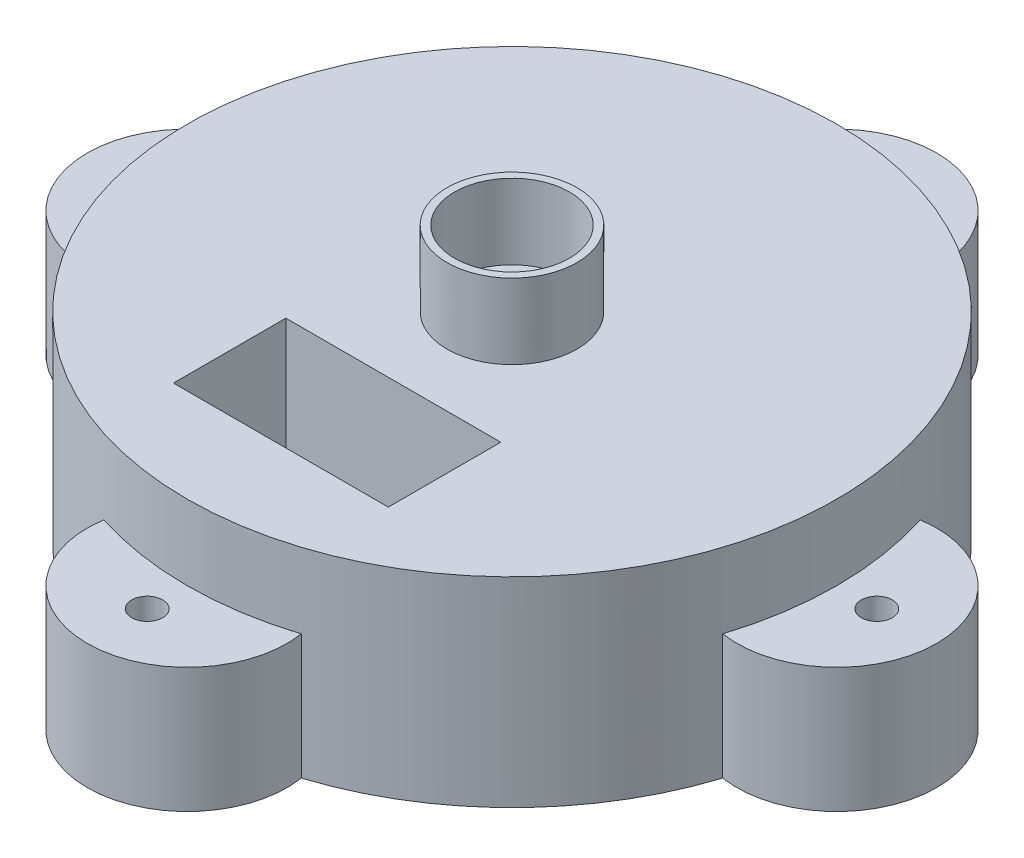
ISO-10303-21;
HEADER;
FILE_DESCRIPTION(('STEP AP214'),'2;1');
FILE_NAME('part.step','',(''),(''),'','','');
FILE_SCHEMA(('AUTOMOTIVE_DESIGN { 1 0 10303 214 1 1 1 1 }'));
ENDSEC;
DATA;
#1=APPLICATION_CONTEXT('core data for automotive mechanical design processes');
#2=APPLICATION_PROTOCOL_DEFINITION('international standard','automotive_design',2000,#1);
#3=PRODUCT_CONTEXT('',#1,'mechanical');
#4=PRODUCT('Part','Part','',(#3));
#5=PRODUCT_RELATED_PRODUCT_CATEGORY('part','',(#4));
#6=PRODUCT_DEFINITION_FORMATION('','',#4);
#7=PRODUCT_DEFINITION_CONTEXT('part definition',#1,'design');
#8=PRODUCT_DEFINITION('design','',#6,#7);
#9=PRODUCT_DEFINITION_SHAPE('','',#8);
#10=(LENGTH_UNIT() NAMED_UNIT(*) SI_UNIT(.MILLI.,.METRE.));
#11=(NAMED_UNIT(*) PLANE_ANGLE_UNIT() SI_UNIT($,.RADIAN.));
#12=(NAMED_UNIT(*) SI_UNIT($,.STERADIAN.) SOLID_ANGLE_UNIT());
#13=UNCERTAINTY_MEASURE_WITH_UNIT(LENGTH_MEASURE(1.E-05),#10,'distance_accuracy_value','');
#14=(GEOMETRIC_REPRESENTATION_CONTEXT(3) GLOBAL_UNCERTAINTY_ASSIGNED_CONTEXT((#13)) GLOBAL_UNIT_ASSIGNED_CONTEXT((#10,
#11,#12)) REPRESENTATION_CONTEXT('',''));
#15=CARTESIAN_POINT('',(0.,0.,0.));
#16=DIRECTION('',(0.,0.,1.));
#17=DIRECTION('',(1.,0.,0.));
#18=AXIS2_PLACEMENT_3D('',#15,#16,#17);
#19=CARTESIAN_POINT('',(0.,40.,0.));
#20=DIRECTION('',(0.,-1.,0.));
#21=DIRECTION('',(0.,0.,-1.));
#22=AXIS2_PLACEMENT_3D('',#19,#20,#21);
#23=CYLINDRICAL_SURFACE('',#22,65.);
#24=DIRECTION('',(0.,-1.,0.));
#25=VECTOR('',#24,1.);
#26=CARTESIAN_POINT('',(61.9230515913332,25.,19.7619756506552));
#27=LINE('',#26,#25);
#28=CARTESIAN_POINT('',(61.9230515913332,25.,19.7619756506552));
#29=VERTEX_POINT('',#28);
#30=CARTESIAN_POINT('',(61.9230515913332,0.,19.7619756506552));
#31=VERTEX_POINT('',#30);
#32=EDGE_CURVE('E231',#29,#31,#27,.T.);
#33=ORIENTED_EDGE('',*,*,#32,.F.);
#34=CARTESIAN_POINT('',(0.,25.,0.));
#35=DIRECTION('',(0.,-1.,0.));
#36=DIRECTION('',(0.,0.,-1.));
#37=AXIS2_PLACEMENT_3D('',#34,#35,#36);
#38=CIRCLE('',#37,65.);
#39=CARTESIAN_POINT('',(61.9231022547189,25.,-19.7618168990512));
#40=VERTEX_POINT('',#39);
#41=EDGE_CURVE('E222',#40,#29,#38,.T.);
#42=ORIENTED_EDGE('',*,*,#41,.F.);
#43=DIRECTION('',(0.,-1.,0.));
#44=VECTOR('',#43,1.);
#45=CARTESIAN_POINT('',(61.9231022547189,25.,-19.7618168990512));
#46=LINE('',#45,#44);
#47=CARTESIAN_POINT('',(61.9231022547189,0.,-19.7618168990512));
#48=VERTEX_POINT('',#47);
#49=EDGE_CURVE('E238',#40,#48,#46,.T.);
#50=ORIENTED_EDGE('',*,*,#49,.T.);
#51=CARTESIAN_POINT('',(0.,0.,0.));
#52=DIRECTION('',(0.,1.,0.));
#53=DIRECTION('',(0.,0.,1.));
#54=AXIS2_PLACEMENT_3D('',#51,#52,#53);
#55=CIRCLE('',#54,65.);
#56=CARTESIAN_POINT('',(19.761975650655,0.,-61.9230515913333));
#57=VERTEX_POINT('',#56);
#58=EDGE_CURVE('E377',#48,#57,#55,.T.);
#59=ORIENTED_EDGE('',*,*,#58,.T.);
#60=DIRECTION('',(0.,-1.,0.));
#61=VECTOR('',#60,1.);
#62=CARTESIAN_POINT('',(19.761975650655,25.,-61.9230515913333));
#63=LINE('',#62,#61);
#64=CARTESIAN_POINT('',(19.761975650655,25.,-61.9230515913333));
#65=VERTEX_POINT('',#64);
#66=EDGE_CURVE('E259',#65,#57,#63,.T.);
#67=ORIENTED_EDGE('',*,*,#66,.F.);
#68=CARTESIAN_POINT('',(0.,25.,0.));
#69=DIRECTION('',(0.,-1.,0.));
#70=DIRECTION('',(0.,0.,-1.));
#71=AXIS2_PLACEMENT_3D('',#68,#69,#70);
#72=CIRCLE('',#71,65.);
#73=CARTESIAN_POINT('',(-19.7618168990514,25.,-61.9231022547188));
#74=VERTEX_POINT('',#73);
#75=EDGE_CURVE('E250',#74,#65,#72,.T.);
#76=ORIENTED_EDGE('',*,*,#75,.F.);
#77=DIRECTION('',(0.,-1.,0.));
#78=VECTOR('',#77,1.);
#79=CARTESIAN_POINT('',(-19.7618168990514,25.,-61.9231022547188));
#80=LINE('',#79,#78);
#81=CARTESIAN_POINT('',(-19.7618168990514,0.,-61.9231022547188));
#82=VERTEX_POINT('',#81);
#83=EDGE_CURVE('E266',#74,#82,#80,.T.);
#84=ORIENTED_EDGE('',*,*,#83,.T.);
#85=CARTESIAN_POINT('',(-61.9230515913333,0.,-19.7619756506548));
#86=VERTEX_POINT('',#85);
#87=EDGE_CURVE('E380',#82,#86,#55,.T.);
#88=ORIENTED_EDGE('',*,*,#87,.T.);
#89=DIRECTION('',(0.,-1.,0.));
#90=VECTOR('',#89,1.);
#91=CARTESIAN_POINT('',(-61.9230515913333,25.,-19.7619756506548));
#92=LINE('',#91,#90);
#93=CARTESIAN_POINT('',(-61.9230515913333,25.,-19.7619756506548));
#94=VERTEX_POINT('',#93);
#95=EDGE_CURVE('E287',#94,#86,#92,.T.);
#96=ORIENTED_EDGE('',*,*,#95,.F.);
#97=CARTESIAN_POINT('',(0.,25.,0.));
#98=DIRECTION('',(0.,-1.,0.));
#99=DIRECTION('',(0.,0.,-1.));
#100=AXIS2_PLACEMENT_3D('',#97,#98,#99);
#101=CIRCLE('',#100,65.);
#102=CARTESIAN_POINT('',(-61.9231022547188,25.,19.7618168990516));
#103=VERTEX_POINT('',#102);
#104=EDGE_CURVE('E278',#103,#94,#101,.T.);
#105=ORIENTED_EDGE('',*,*,#104,.F.);
#106=DIRECTION('',(0.,-1.,0.));
#107=VECTOR('',#106,1.);
#108=CARTESIAN_POINT('',(-61.9231022547188,25.,19.7618168990516));
#109=LINE('',#108,#107);
#110=CARTESIAN_POINT('',(-61.9231022547188,0.,19.7618168990516));
#111=VERTEX_POINT('',#110);
#112=EDGE_CURVE('E294',#103,#111,#109,.T.);
#113=ORIENTED_EDGE('',*,*,#112,.T.);
#114=CARTESIAN_POINT('',(-19.7619756506545,0.,61.9230515913334));
#115=VERTEX_POINT('',#114);
#116=EDGE_CURVE('E372',#111,#115,#55,.T.);
#117=ORIENTED_EDGE('',*,*,#116,.T.);
#118=DIRECTION('',(0.,-1.,0.));
#119=VECTOR('',#118,1.);
#120=CARTESIAN_POINT('',(-19.7619756506545,25.,61.9230515913334));
#121=LINE('',#120,#119);
#122=CARTESIAN_POINT('',(-19.7619756506545,25.,61.9230515913334));
#123=VERTEX_POINT('',#122);
#124=EDGE_CURVE('E315',#123,#115,#121,.T.);
#125=ORIENTED_EDGE('',*,*,#124,.F.);
#126=CARTESIAN_POINT('',(0.,25.,0.));
#127=DIRECTION('',(0.,-1.,0.));
#128=DIRECTION('',(0.,0.,-1.));
#129=AXIS2_PLACEMENT_3D('',#126,#127,#128);
#130=CIRCLE('',#129,65.);
#131=CARTESIAN_POINT('',(19.7618168990518,25.,61.9231022547187));
#132=VERTEX_POINT('',#131);
#133=EDGE_CURVE('E311',#132,#123,#130,.T.);
#134=ORIENTED_EDGE('',*,*,#133,.F.);
#135=DIRECTION('',(0.,-1.,0.));
#136=VECTOR('',#135,1.);
#137=CARTESIAN_POINT('',(19.7618168990518,25.,61.9231022547187));
#138=LINE('',#137,#136);
#139=CARTESIAN_POINT('',(19.7618168990518,0.,61.9231022547187));
#140=VERTEX_POINT('',#139);
#141=EDGE_CURVE('E322',#132,#140,#138,.T.);
#142=ORIENTED_EDGE('',*,*,#141,.T.);
#143=EDGE_CURVE('E375',#140,#31,#55,.T.);
#144=ORIENTED_EDGE('',*,*,#143,.T.);
#145=EDGE_LOOP('',(#33,#42,#50,#59,#67,#76,#84,#88,#96,#105,#113,#117,#125,#134,#142,#144));
#146=FACE_BOUND('',#145,.T.);
#147=CARTESIAN_POINT('',(0.,40.,0.));
#148=DIRECTION('',(0.,1.,0.));
#149=DIRECTION('',(0.,0.,1.));
#150=AXIS2_PLACEMENT_3D('',#147,#148,#149);
#151=CIRCLE('',#150,65.);
#152=CARTESIAN_POINT('',(0.,40.,65.));
#153=VERTEX_POINT('',#152);
#154=EDGE_CURVE('E53',#153,#153,#151,.T.);
#155=ORIENTED_EDGE('',*,*,#154,.F.);
#156=EDGE_LOOP('',(#155));
#157=FACE_BOUND('',#156,.T.);
#158=DIRECTION('',(0.,-1.,0.));
#159=VECTOR('',#158,1.);
#160=CARTESIAN_POINT('',(-58.4024663648858,40.,28.5333475515648));
#161=LINE('',#160,#159);
#162=CARTESIAN_POINT('',(-58.4024663648858,12.326049230071,28.5333475515648));
#163=VERTEX_POINT('',#162);
#164=CARTESIAN_POINT('',(-58.4024663648858,7.32604923007102,28.5333475515648));
#165=VERTEX_POINT('',#164);
#166=EDGE_CURVE('E161',#163,#165,#161,.T.);
#167=ORIENTED_EDGE('',*,*,#166,.F.);
#168=CARTESIAN_POINT('',(0.,12.326049230071,0.));
#169=DIRECTION('',(0.,-1.,0.));
#170=DIRECTION('',(0.,0.,-1.));
#171=AXIS2_PLACEMENT_3D('',#168,#169,#170);
#172=CIRCLE('',#171,65.);
#173=CARTESIAN_POINT('',(-48.2684954287439,12.326049230071,43.5333475515648));
#174=VERTEX_POINT('',#173);
#175=EDGE_CURVE('E165',#174,#163,#172,.T.);
#176=ORIENTED_EDGE('',*,*,#175,.F.);
#177=DIRECTION('',(0.,-1.,0.));
#178=VECTOR('',#177,1.);
#179=CARTESIAN_POINT('',(-48.2684954287439,40.,43.5333475515648));
#180=LINE('',#179,#178);
#181=CARTESIAN_POINT('',(-48.2684954287439,7.32604923007102,43.5333475515648));
#182=VERTEX_POINT('',#181);
#183=EDGE_CURVE('E197',#182,#174,#180,.F.);
#184=ORIENTED_EDGE('',*,*,#183,.F.);
#185=CARTESIAN_POINT('',(0.,7.32604923007102,0.));
#186=DIRECTION('',(0.,1.,0.));
#187=DIRECTION('',(0.,0.,1.));
#188=AXIS2_PLACEMENT_3D('',#185,#186,#187);
#189=CIRCLE('',#188,65.);
#190=EDGE_CURVE('E200',#165,#182,#189,.T.);
#191=ORIENTED_EDGE('',*,*,#190,.F.);
#192=EDGE_LOOP('',(#167,#176,#184,#191));
#193=FACE_BOUND('',#192,.T.);
#194=ADVANCED_FACE('F45',(#146,#157,#193),#23,.T.);
#195=CARTESIAN_POINT('',(-21.5,2.,23.75));
#196=DIRECTION('',(1.,0.,0.));
#197=DIRECTION('',(0.,0.,-1.));
#198=AXIS2_PLACEMENT_3D('',#195,#196,#197);
#199=PLANE('',#198);
#200=DIRECTION('',(0.,0.,-1.));
#201=VECTOR('',#200,1.);
#202=CARTESIAN_POINT('',(-21.5,40.,23.75));
#203=LINE('',#202,#201);
#204=CARTESIAN_POINT('',(-21.5,40.,46.25));
#205=VERTEX_POINT('',#204);
#206=CARTESIAN_POINT('',(-21.5,40.,23.75));
#207=VERTEX_POINT('',#206);
#208=EDGE_CURVE('E326',#205,#207,#203,.T.);
#209=ORIENTED_EDGE('',*,*,#208,.F.);
#210=DIRECTION('',(0.,1.,0.));
#211=VECTOR('',#210,1.);
#212=CARTESIAN_POINT('',(-21.5,2.,46.25));
#213=LINE('',#212,#211);
#214=CARTESIAN_POINT('',(-21.5,2.,46.25));
#215=VERTEX_POINT('',#214);
#216=EDGE_CURVE('E344',#215,#205,#213,.T.);
#217=ORIENTED_EDGE('',*,*,#216,.F.);
#218=DIRECTION('',(0.,0.,-1.));
#219=VECTOR('',#218,1.);
#220=CARTESIAN_POINT('',(-21.5,2.,23.75));
#221=LINE('',#220,#219);
#222=CARTESIAN_POINT('',(-21.5,2.,23.75));
#223=VERTEX_POINT('',#222);
#224=EDGE_CURVE('E330',#215,#223,#221,.T.);
#225=ORIENTED_EDGE('',*,*,#224,.T.);
#226=DIRECTION('',(0.,1.,0.));
#227=VECTOR('',#226,1.);
#228=CARTESIAN_POINT('',(-21.5,2.,23.75));
#229=LINE('',#228,#227);
#230=EDGE_CURVE('E368',#223,#207,#229,.T.);
#231=ORIENTED_EDGE('',*,*,#230,.T.);
#232=EDGE_LOOP('',(#209,#217,#225,#231));
#233=FACE_BOUND('',#232,.T.);
#234=DIRECTION('',(0.,0.,-1.));
#235=VECTOR('',#234,1.);
#236=CARTESIAN_POINT('',(-21.5,12.326049230071,43.5333475515648));
#237=LINE('',#236,#235);
#238=CARTESIAN_POINT('',(-21.5,12.326049230071,43.5333475515648));
#239=VERTEX_POINT('',#238);
#240=CARTESIAN_POINT('',(-21.5,12.326049230071,28.5333475515648));
#241=VERTEX_POINT('',#240);
#242=EDGE_CURVE('E180',#239,#241,#237,.T.);
#243=ORIENTED_EDGE('',*,*,#242,.T.);
#244=DIRECTION('',(0.,-1.,0.));
#245=VECTOR('',#244,1.);
#246=CARTESIAN_POINT('',(-21.5,7.32604923007102,28.5333475515648));
#247=LINE('',#246,#245);
#248=CARTESIAN_POINT('',(-21.5,7.32604923007102,28.5333475515648));
#249=VERTEX_POINT('',#248);
#250=EDGE_CURVE('E68',#241,#249,#247,.T.);
#251=ORIENTED_EDGE('',*,*,#250,.T.);
#252=DIRECTION('',(0.,0.,1.));
#253=VECTOR('',#252,1.);
#254=CARTESIAN_POINT('',(-21.5,7.32604923007102,43.5333475515648));
#255=LINE('',#254,#253);
#256=CARTESIAN_POINT('',(-21.5,7.32604923007102,43.5333475515648));
#257=VERTEX_POINT('',#256);
#258=EDGE_CURVE('E169',#249,#257,#255,.T.);
#259=ORIENTED_EDGE('',*,*,#258,.T.);
#260=DIRECTION('',(0.,1.,0.));
#261=VECTOR('',#260,1.);
#262=CARTESIAN_POINT('',(-21.5,7.32604923007102,43.5333475515648));
#263=LINE('',#262,#261);
#264=EDGE_CURVE('E176',#257,#239,#263,.T.);
#265=ORIENTED_EDGE('',*,*,#264,.T.);
#266=EDGE_LOOP('',(#243,#251,#259,#265));
#267=FACE_BOUND('',#266,.T.);
#268=ADVANCED_FACE('F179',(#233,#267),#199,.T.);
#269=CARTESIAN_POINT('',(0.,40.,0.));
#270=DIRECTION('',(0.,1.,0.));
#271=DIRECTION('',(0.,0.,1.));
#272=AXIS2_PLACEMENT_3D('',#269,#270,#271);
#273=PLANE('',#272);
#274=CARTESIAN_POINT('',(0.,40.,0.));
#275=DIRECTION('',(0.,1.,0.));
#276=DIRECTION('',(0.,0.,1.));
#277=AXIS2_PLACEMENT_3D('',#274,#275,#276);
#278=CIRCLE('',#277,13.);
#279=CARTESIAN_POINT('',(0.,40.,13.));
#280=VERTEX_POINT('',#279);
#281=EDGE_CURVE('E11',#280,#280,#278,.T.);
#282=ORIENTED_EDGE('',*,*,#281,.F.);
#283=EDGE_LOOP('',(#282));
#284=FACE_BOUND('',#283,.T.);
#285=ORIENTED_EDGE('',*,*,#154,.T.);
#286=EDGE_LOOP('',(#285));
#287=FACE_BOUND('',#286,.T.);
#288=DIRECTION('',(-1.,0.,0.));
#289=VECTOR('',#288,1.);
#290=CARTESIAN_POINT('',(21.5,40.,46.25));
#291=LINE('',#290,#289);
#292=CARTESIAN_POINT('',(21.5,40.,46.25));
#293=VERTEX_POINT('',#292);
#294=EDGE_CURVE('E335',#293,#205,#291,.T.);
#295=ORIENTED_EDGE('',*,*,#294,.T.);
#296=ORIENTED_EDGE('',*,*,#208,.T.);
#297=DIRECTION('',(1.,0.,0.));
#298=VECTOR('',#297,1.);
#299=CARTESIAN_POINT('',(21.5,40.,23.75));
#300=LINE('',#299,#298);
#301=CARTESIAN_POINT('',(21.5,40.,23.75));
#302=VERTEX_POINT('',#301);
#303=EDGE_CURVE('E348',#207,#302,#300,.T.);
#304=ORIENTED_EDGE('',*,*,#303,.T.);
#305=DIRECTION('',(0.,0.,1.));
#306=VECTOR('',#305,1.);
#307=CARTESIAN_POINT('',(21.5,40.,23.75));
#308=LINE('',#307,#306);
#309=EDGE_CURVE('E352',#302,#293,#308,.T.);
#310=ORIENTED_EDGE('',*,*,#309,.T.);
#311=EDGE_LOOP('',(#295,#296,#304,#310));
#312=FACE_BOUND('',#311,.T.);
#313=ADVANCED_FACE('F412',(#284,#287,#312),#273,.T.);
#314=CARTESIAN_POINT('',(0.,0.,0.));
#315=DIRECTION('',(0.,1.,0.));
#316=DIRECTION('',(0.,0.,1.));
#317=AXIS2_PLACEMENT_3D('',#314,#315,#316);
#318=PLANE('',#317);
#319=ORIENTED_EDGE('',*,*,#143,.F.);
#320=CARTESIAN_POINT('',(-8.33199405442242E-05,0.,64.9999999999466));
#321=DIRECTION('',(0.,-1.,0.));
#322=DIRECTION('',(0.,0.,-1.));
#323=AXIS2_PLACEMENT_3D('',#320,#321,#322);
#324=CIRCLE('',#323,20.);
#325=EDGE_CURVE('E307',#115,#140,#324,.F.);
#326=ORIENTED_EDGE('',*,*,#325,.F.);
#327=ORIENTED_EDGE('',*,*,#116,.F.);
#328=CARTESIAN_POINT('',(-64.9999999999466,0.,-8.33199407711705E-05));
#329=DIRECTION('',(0.,-1.,0.));
#330=DIRECTION('',(0.,0.,-1.));
#331=AXIS2_PLACEMENT_3D('',#328,#329,#330);
#332=CIRCLE('',#331,20.);
#333=EDGE_CURVE('E270',#86,#111,#332,.F.);
#334=ORIENTED_EDGE('',*,*,#333,.F.);
#335=ORIENTED_EDGE('',*,*,#87,.F.);
#336=CARTESIAN_POINT('',(8.33199409981168E-05,0.,-64.9999999999466));
#337=DIRECTION('',(0.,-1.,0.));
#338=DIRECTION('',(0.,0.,-1.));
#339=AXIS2_PLACEMENT_3D('',#336,#337,#338);
#340=CIRCLE('',#339,20.);
#341=EDGE_CURVE('E242',#57,#82,#340,.F.);
#342=ORIENTED_EDGE('',*,*,#341,.F.);
#343=ORIENTED_EDGE('',*,*,#58,.F.);
#344=CARTESIAN_POINT('',(64.9999999999466,0.,8.33199412250631E-05));
#345=DIRECTION('',(0.,-1.,0.));
#346=DIRECTION('',(0.,0.,-1.));
#347=AXIS2_PLACEMENT_3D('',#344,#345,#346);
#348=CIRCLE('',#347,20.);
#349=EDGE_CURVE('E217',#31,#48,#348,.F.);
#350=ORIENTED_EDGE('',*,*,#349,.F.);
#351=EDGE_LOOP('',(#319,#326,#327,#334,#335,#342,#343,#350));
#352=FACE_BOUND('',#351,.T.);
#353=CARTESIAN_POINT('',(-8.33199405432445E-05,0.,72.9999999999466));
#354=DIRECTION('',(0.,-1.,0.));
#355=DIRECTION('',(0.,0.,-1.));
#356=AXIS2_PLACEMENT_3D('',#353,#354,#355);
#357=CIRCLE('',#356,3.1);
#358=CARTESIAN_POINT('',(-8.33199405432445E-05,0.,69.8999999999466));
#359=VERTEX_POINT('',#358);
#360=EDGE_CURVE('E298',#359,#359,#357,.F.);
#361=ORIENTED_EDGE('',*,*,#360,.T.);
#362=EDGE_LOOP('',(#361));
#363=FACE_BOUND('',#362,.T.);
#364=CARTESIAN_POINT('',(-72.9999999999466,0.,-8.33199407981226E-05));
#365=DIRECTION('',(0.,-1.,0.));
#366=DIRECTION('',(0.,0.,-1.));
#367=AXIS2_PLACEMENT_3D('',#364,#365,#366);
#368=CIRCLE('',#367,3.1);
#369=CARTESIAN_POINT('',(-72.9999999999466,0.,-3.1000833199408));
#370=VERTEX_POINT('',#369);
#371=EDGE_CURVE('E279',#370,#370,#368,.F.);
#372=ORIENTED_EDGE('',*,*,#371,.T.);
#373=EDGE_LOOP('',(#372));
#374=FACE_BOUND('',#373,.T.);
#375=CARTESIAN_POINT('',(8.33199410530008E-05,0.,-72.9999999999466));
#376=DIRECTION('',(0.,-1.,0.));
#377=DIRECTION('',(0.,0.,-1.));
#378=AXIS2_PLACEMENT_3D('',#375,#376,#377);
#379=CIRCLE('',#378,3.1);
#380=CARTESIAN_POINT('',(8.33199410530008E-05,0.,-76.0999999999466));
#381=VERTEX_POINT('',#380);
#382=EDGE_CURVE('E251',#381,#381,#379,.F.);
#383=ORIENTED_EDGE('',*,*,#382,.T.);
#384=EDGE_LOOP('',(#383));
#385=FACE_BOUND('',#384,.T.);
#386=CARTESIAN_POINT('',(72.9999999999466,0.,8.33199413078789E-05));
#387=DIRECTION('',(0.,-1.,0.));
#388=DIRECTION('',(0.,0.,-1.));
#389=AXIS2_PLACEMENT_3D('',#386,#387,#388);
#390=CIRCLE('',#389,3.1);
#391=CARTESIAN_POINT('',(72.9999999999466,0.,-3.09991668005869));
#392=VERTEX_POINT('',#391);
#393=EDGE_CURVE('E223',#392,#392,#390,.F.);
#394=ORIENTED_EDGE('',*,*,#393,.T.);
#395=EDGE_LOOP('',(#394));
#396=FACE_BOUND('',#395,.T.);
#397=ADVANCED_FACE('F392',(#352,#363,#374,#385,#396),#318,.F.);
#398=CARTESIAN_POINT('',(21.5,2.,23.75));
#399=DIRECTION('',(0.,0.,1.));
#400=DIRECTION('',(1.,0.,0.));
#401=AXIS2_PLACEMENT_3D('',#398,#399,#400);
#402=PLANE('',#401);
#403=ORIENTED_EDGE('',*,*,#303,.F.);
#404=ORIENTED_EDGE('',*,*,#230,.F.);
#405=DIRECTION('',(1.,0.,0.));
#406=VECTOR('',#405,1.);
#407=CARTESIAN_POINT('',(21.5,2.,23.75));
#408=LINE('',#407,#406);
#409=CARTESIAN_POINT('',(21.5,2.,23.75));
#410=VERTEX_POINT('',#409);
#411=EDGE_CURVE('E334',#223,#410,#408,.T.);
#412=ORIENTED_EDGE('',*,*,#411,.T.);
#413=DIRECTION('',(0.,1.,0.));
#414=VECTOR('',#413,1.);
#415=CARTESIAN_POINT('',(21.5,2.,23.75));
#416=LINE('',#415,#414);
#417=EDGE_CURVE('E365',#410,#302,#416,.T.);
#418=ORIENTED_EDGE('',*,*,#417,.T.);
#419=EDGE_LOOP('',(#403,#404,#412,#418));
#420=FACE_BOUND('',#419,.T.);
#421=ADVANCED_FACE('F411',(#420),#402,.T.);
#422=CARTESIAN_POINT('',(21.5,2.,23.75));
#423=DIRECTION('',(-1.,0.,0.));
#424=DIRECTION('',(0.,0.,1.));
#425=AXIS2_PLACEMENT_3D('',#422,#423,#424);
#426=PLANE('',#425);
#427=ORIENTED_EDGE('',*,*,#309,.F.);
#428=ORIENTED_EDGE('',*,*,#417,.F.);
#429=DIRECTION('',(0.,0.,1.));
#430=VECTOR('',#429,1.);
#431=CARTESIAN_POINT('',(21.5,2.,23.75));
#432=LINE('',#431,#430);
#433=CARTESIAN_POINT('',(21.5,2.,46.25));
#434=VERTEX_POINT('',#433);
#435=EDGE_CURVE('E338',#410,#434,#432,.T.);
#436=ORIENTED_EDGE('',*,*,#435,.T.);
#437=DIRECTION('',(0.,1.,0.));
#438=VECTOR('',#437,1.);
#439=CARTESIAN_POINT('',(21.5,2.,46.25));
#440=LINE('',#439,#438);
#441=EDGE_CURVE('E362',#434,#293,#440,.T.);
#442=ORIENTED_EDGE('',*,*,#441,.T.);
#443=EDGE_LOOP('',(#427,#428,#436,#442));
#444=FACE_BOUND('',#443,.T.);
#445=ADVANCED_FACE('F450',(#444),#426,.T.);
#446=CARTESIAN_POINT('',(21.5,2.,46.25));
#447=DIRECTION('',(0.,0.,-1.));
#448=DIRECTION('',(0.,1.,0.));
#449=AXIS2_PLACEMENT_3D('',#446,#447,#448);
#450=PLANE('',#449);
#451=ORIENTED_EDGE('',*,*,#294,.F.);
#452=ORIENTED_EDGE('',*,*,#441,.F.);
#453=DIRECTION('',(-1.,0.,0.));
#454=VECTOR('',#453,1.);
#455=CARTESIAN_POINT('',(21.5,2.,46.25));
#456=LINE('',#455,#454);
#457=EDGE_CURVE('E341',#434,#215,#456,.T.);
#458=ORIENTED_EDGE('',*,*,#457,.T.);
#459=ORIENTED_EDGE('',*,*,#216,.T.);
#460=EDGE_LOOP('',(#451,#452,#458,#459));
#461=FACE_BOUND('',#460,.T.);
#462=ADVANCED_FACE('F454',(#461),#450,.T.);
#463=CARTESIAN_POINT('',(0.,2.,0.));
#464=DIRECTION('',(0.,-1.,0.));
#465=DIRECTION('',(0.,0.,-1.));
#466=AXIS2_PLACEMENT_3D('',#463,#464,#465);
#467=PLANE('',#466);
#468=ORIENTED_EDGE('',*,*,#224,.F.);
#469=ORIENTED_EDGE('',*,*,#457,.F.);
#470=ORIENTED_EDGE('',*,*,#435,.F.);
#471=ORIENTED_EDGE('',*,*,#411,.F.);
#472=EDGE_LOOP('',(#468,#469,#470,#471));
#473=FACE_BOUND('',#472,.T.);
#474=ADVANCED_FACE('F458',(#473),#467,.F.);
#475=CARTESIAN_POINT('',(-8.33199405442242E-05,25.,64.9999999999466));
#476=DIRECTION('',(0.,-1.,0.));
#477=DIRECTION('',(0.,0.,-1.));
#478=AXIS2_PLACEMENT_3D('',#475,#476,#477);
#479=CYLINDRICAL_SURFACE('',#478,20.);
#480=ORIENTED_EDGE('',*,*,#325,.T.);
#481=ORIENTED_EDGE('',*,*,#141,.F.);
#482=CARTESIAN_POINT('',(-8.33199405442242E-05,25.,64.9999999999466));
#483=DIRECTION('',(0.,-1.,0.));
#484=DIRECTION('',(0.,0.,-1.));
#485=AXIS2_PLACEMENT_3D('',#482,#483,#484);
#486=CIRCLE('',#485,20.);
#487=EDGE_CURVE('E306',#123,#132,#486,.F.);
#488=ORIENTED_EDGE('',*,*,#487,.F.);
#489=ORIENTED_EDGE('',*,*,#124,.T.);
#490=EDGE_LOOP('',(#480,#481,#488,#489));
#491=FACE_BOUND('',#490,.T.);
#492=ADVANCED_FACE('F462',(#491),#479,.T.);
#493=CARTESIAN_POINT('',(-8.33199405432445E-05,25.,72.9999999999466));
#494=DIRECTION('',(0.,-1.,0.));
#495=DIRECTION('',(0.,0.,-1.));
#496=AXIS2_PLACEMENT_3D('',#493,#494,#495);
#497=CYLINDRICAL_SURFACE('',#496,3.1);
#498=CARTESIAN_POINT('',(-8.33199405432445E-05,25.,72.9999999999466));
#499=DIRECTION('',(0.,-1.,0.));
#500=DIRECTION('',(0.,0.,-1.));
#501=AXIS2_PLACEMENT_3D('',#498,#499,#500);
#502=CIRCLE('',#501,3.1);
#503=CARTESIAN_POINT('',(-8.33199405432445E-05,25.,69.8999999999466));
#504=VERTEX_POINT('',#503);
#505=EDGE_CURVE('E302',#504,#504,#502,.F.);
#506=ORIENTED_EDGE('',*,*,#505,.T.);
#507=EDGE_LOOP('',(#506));
#508=FACE_BOUND('',#507,.T.);
#509=ORIENTED_EDGE('',*,*,#360,.F.);
#510=EDGE_LOOP('',(#509));
#511=FACE_BOUND('',#510,.T.);
#512=ADVANCED_FACE('F464',(#508,#511),#497,.F.);
#513=CARTESIAN_POINT('',(0.,25.,0.));
#514=DIRECTION('',(0.,-1.,0.));
#515=DIRECTION('',(0.,0.,-1.));
#516=AXIS2_PLACEMENT_3D('',#513,#514,#515);
#517=PLANE('',#516);
#518=ORIENTED_EDGE('',*,*,#505,.F.);
#519=EDGE_LOOP('',(#518));
#520=FACE_BOUND('',#519,.T.);
#521=ORIENTED_EDGE('',*,*,#487,.T.);
#522=ORIENTED_EDGE('',*,*,#133,.T.);
#523=EDGE_LOOP('',(#521,#522));
#524=FACE_BOUND('',#523,.T.);
#525=ADVANCED_FACE('F467',(#520,#524),#517,.F.);
#526=CARTESIAN_POINT('',(-64.9999999999466,25.,-8.33199407696397E-05));
#527=DIRECTION('',(0.,-1.,0.));
#528=DIRECTION('',(0.,0.,-1.));
#529=AXIS2_PLACEMENT_3D('',#526,#527,#528);
#530=CYLINDRICAL_SURFACE('',#529,20.);
#531=ORIENTED_EDGE('',*,*,#333,.T.);
#532=ORIENTED_EDGE('',*,*,#112,.F.);
#533=CARTESIAN_POINT('',(-64.9999999999466,25.,-8.33199407696397E-05));
#534=DIRECTION('',(0.,-1.,0.));
#535=DIRECTION('',(0.,0.,-1.));
#536=AXIS2_PLACEMENT_3D('',#533,#534,#535);
#537=CIRCLE('',#536,20.);
#538=EDGE_CURVE('E274',#94,#103,#537,.F.);
#539=ORIENTED_EDGE('',*,*,#538,.F.);
#540=ORIENTED_EDGE('',*,*,#95,.T.);
#541=EDGE_LOOP('',(#531,#532,#539,#540));
#542=FACE_BOUND('',#541,.T.);
#543=ADVANCED_FACE('F390',(#542),#530,.T.);
#544=CARTESIAN_POINT('',(-72.9999999999466,25.,-8.33199407965918E-05));
#545=DIRECTION('',(0.,-1.,0.));
#546=DIRECTION('',(0.,0.,-1.));
#547=AXIS2_PLACEMENT_3D('',#544,#545,#546);
#548=CYLINDRICAL_SURFACE('',#547,3.1);
#549=CARTESIAN_POINT('',(-72.9999999999466,25.,-8.33199407965918E-05));
#550=DIRECTION('',(0.,-1.,0.));
#551=DIRECTION('',(0.,0.,-1.));
#552=AXIS2_PLACEMENT_3D('',#549,#550,#551);
#553=CIRCLE('',#552,3.1);
#554=CARTESIAN_POINT('',(-72.9999999999466,25.,-3.1000833199408));
#555=VERTEX_POINT('',#554);
#556=EDGE_CURVE('E283',#555,#555,#553,.F.);
#557=ORIENTED_EDGE('',*,*,#556,.T.);
#558=EDGE_LOOP('',(#557));
#559=FACE_BOUND('',#558,.T.);
#560=ORIENTED_EDGE('',*,*,#371,.F.);
#561=EDGE_LOOP('',(#560));
#562=FACE_BOUND('',#561,.T.);
#563=ADVANCED_FACE('F400',(#559,#562),#548,.F.);
#564=CARTESIAN_POINT('',(0.,25.,0.));
#565=DIRECTION('',(0.,-1.,0.));
#566=DIRECTION('',(0.,0.,-1.));
#567=AXIS2_PLACEMENT_3D('',#564,#565,#566);
#568=PLANE('',#567);
#569=ORIENTED_EDGE('',*,*,#538,.T.);
#570=ORIENTED_EDGE('',*,*,#104,.T.);
#571=EDGE_LOOP('',(#569,#570));
#572=FACE_BOUND('',#571,.T.);
#573=ORIENTED_EDGE('',*,*,#556,.F.);
#574=EDGE_LOOP('',(#573));
#575=FACE_BOUND('',#574,.T.);
#576=ADVANCED_FACE('F396',(#572,#575),#568,.F.);
#577=CARTESIAN_POINT('',(8.33199409981168E-05,25.,-64.9999999999466));
#578=DIRECTION('',(0.,-1.,0.));
#579=DIRECTION('',(0.,0.,-1.));
#580=AXIS2_PLACEMENT_3D('',#577,#578,#579);
#581=CYLINDRICAL_SURFACE('',#580,20.);
#582=ORIENTED_EDGE('',*,*,#341,.T.);
#583=ORIENTED_EDGE('',*,*,#83,.F.);
#584=CARTESIAN_POINT('',(8.33199409981168E-05,25.,-64.9999999999466));
#585=DIRECTION('',(0.,-1.,0.));
#586=DIRECTION('',(0.,0.,-1.));
#587=AXIS2_PLACEMENT_3D('',#584,#585,#586);
#588=CIRCLE('',#587,20.);
#589=EDGE_CURVE('E246',#65,#74,#588,.F.);
#590=ORIENTED_EDGE('',*,*,#589,.F.);
#591=ORIENTED_EDGE('',*,*,#66,.T.);
#592=EDGE_LOOP('',(#582,#583,#590,#591));
#593=FACE_BOUND('',#592,.T.);
#594=ADVANCED_FACE('F399',(#593),#581,.T.);
#595=CARTESIAN_POINT('',(8.33199410530008E-05,25.,-72.9999999999466));
#596=DIRECTION('',(0.,-1.,0.));
#597=DIRECTION('',(0.,0.,-1.));
#598=AXIS2_PLACEMENT_3D('',#595,#596,#597);
#599=CYLINDRICAL_SURFACE('',#598,3.1);
#600=CARTESIAN_POINT('',(8.33199410530008E-05,25.,-72.9999999999466));
#601=DIRECTION('',(0.,-1.,0.));
#602=DIRECTION('',(0.,0.,-1.));
#603=AXIS2_PLACEMENT_3D('',#600,#601,#602);
#604=CIRCLE('',#603,3.1);
#605=CARTESIAN_POINT('',(8.33199410530008E-05,25.,-76.0999999999466));
#606=VERTEX_POINT('',#605);
#607=EDGE_CURVE('E255',#606,#606,#604,.F.);
#608=ORIENTED_EDGE('',*,*,#607,.T.);
#609=EDGE_LOOP('',(#608));
#610=FACE_BOUND('',#609,.T.);
#611=ORIENTED_EDGE('',*,*,#382,.F.);
#612=EDGE_LOOP('',(#611));
#613=FACE_BOUND('',#612,.T.);
#614=ADVANCED_FACE('F479',(#610,#613),#599,.F.);
#615=CARTESIAN_POINT('',(0.,25.,0.));
#616=DIRECTION('',(0.,-1.,0.));
#617=DIRECTION('',(0.,0.,-1.));
#618=AXIS2_PLACEMENT_3D('',#615,#616,#617);
#619=PLANE('',#618);
#620=ORIENTED_EDGE('',*,*,#589,.T.);
#621=ORIENTED_EDGE('',*,*,#75,.T.);
#622=EDGE_LOOP('',(#620,#621));
#623=FACE_BOUND('',#622,.T.);
#624=ORIENTED_EDGE('',*,*,#607,.F.);
#625=EDGE_LOOP('',(#624));
#626=FACE_BOUND('',#625,.T.);
#627=ADVANCED_FACE('F430',(#623,#626),#619,.F.);
#628=CARTESIAN_POINT('',(64.9999999999466,25.,8.33199412265939E-05));
#629=DIRECTION('',(0.,-1.,0.));
#630=DIRECTION('',(0.,0.,-1.));
#631=AXIS2_PLACEMENT_3D('',#628,#629,#630);
#632=CYLINDRICAL_SURFACE('',#631,20.);
#633=ORIENTED_EDGE('',*,*,#349,.T.);
#634=ORIENTED_EDGE('',*,*,#49,.F.);
#635=CARTESIAN_POINT('',(64.9999999999466,25.,8.33199412265939E-05));
#636=DIRECTION('',(0.,-1.,0.));
#637=DIRECTION('',(0.,0.,-1.));
#638=AXIS2_PLACEMENT_3D('',#635,#636,#637);
#639=CIRCLE('',#638,20.);
#640=EDGE_CURVE('E218',#29,#40,#639,.F.);
#641=ORIENTED_EDGE('',*,*,#640,.F.);
#642=ORIENTED_EDGE('',*,*,#32,.T.);
#643=EDGE_LOOP('',(#633,#634,#641,#642));
#644=FACE_BOUND('',#643,.T.);
#645=ADVANCED_FACE('F420',(#644),#632,.T.);
#646=CARTESIAN_POINT('',(72.9999999999466,25.,8.33199413094097E-05));
#647=DIRECTION('',(0.,-1.,0.));
#648=DIRECTION('',(0.,0.,-1.));
#649=AXIS2_PLACEMENT_3D('',#646,#647,#648);
#650=CYLINDRICAL_SURFACE('',#649,3.1);
#651=CARTESIAN_POINT('',(72.9999999999466,25.,8.33199413094097E-05));
#652=DIRECTION('',(0.,-1.,0.));
#653=DIRECTION('',(0.,0.,-1.));
#654=AXIS2_PLACEMENT_3D('',#651,#652,#653);
#655=CIRCLE('',#654,3.1);
#656=CARTESIAN_POINT('',(72.9999999999466,25.,-3.09991668005869));
#657=VERTEX_POINT('',#656);
#658=EDGE_CURVE('E227',#657,#657,#655,.F.);
#659=ORIENTED_EDGE('',*,*,#658,.T.);
#660=EDGE_LOOP('',(#659));
#661=FACE_BOUND('',#660,.T.);
#662=ORIENTED_EDGE('',*,*,#393,.F.);
#663=EDGE_LOOP('',(#662));
#664=FACE_BOUND('',#663,.T.);
#665=ADVANCED_FACE('F417',(#661,#664),#650,.F.);
#666=CARTESIAN_POINT('',(0.,25.,0.));
#667=DIRECTION('',(0.,-1.,0.));
#668=DIRECTION('',(0.,0.,-1.));
#669=AXIS2_PLACEMENT_3D('',#666,#667,#668);
#670=PLANE('',#669);
#671=ORIENTED_EDGE('',*,*,#640,.T.);
#672=ORIENTED_EDGE('',*,*,#41,.T.);
#673=EDGE_LOOP('',(#671,#672));
#674=FACE_BOUND('',#673,.T.);
#675=ORIENTED_EDGE('',*,*,#658,.F.);
#676=EDGE_LOOP('',(#675));
#677=FACE_BOUND('',#676,.T.);
#678=ADVANCED_FACE('F419',(#674,#677),#670,.F.);
#679=CARTESIAN_POINT('',(0.,55.,0.));
#680=DIRECTION('',(0.,-1.,0.));
#681=DIRECTION('',(0.,0.,-1.));
#682=AXIS2_PLACEMENT_3D('',#679,#680,#681);
#683=CYLINDRICAL_SURFACE('',#682,13.);
#684=CARTESIAN_POINT('',(0.,55.,0.));
#685=DIRECTION('',(0.,-1.,0.));
#686=DIRECTION('',(0.,0.,-1.));
#687=AXIS2_PLACEMENT_3D('',#684,#685,#686);
#688=CIRCLE('',#687,13.);
#689=CARTESIAN_POINT('',(0.,55.,-13.));
#690=VERTEX_POINT('',#689);
#691=EDGE_CURVE('E210',#690,#690,#688,.T.);
#692=ORIENTED_EDGE('',*,*,#691,.T.);
#693=EDGE_LOOP('',(#692));
#694=FACE_BOUND('',#693,.T.);
#695=ORIENTED_EDGE('',*,*,#281,.T.);
#696=EDGE_LOOP('',(#695));
#697=FACE_BOUND('',#696,.T.);
#698=ADVANCED_FACE('F427',(#694,#697),#683,.T.);
#699=CARTESIAN_POINT('',(0.,55.,0.));
#700=DIRECTION('',(0.,-1.,0.));
#701=DIRECTION('',(0.,0.,-1.));
#702=AXIS2_PLACEMENT_3D('',#699,#700,#701);
#703=PLANE('',#702);
#704=CARTESIAN_POINT('',(0.,55.,0.));
#705=DIRECTION('',(0.,-1.,0.));
#706=DIRECTION('',(0.,0.,-1.));
#707=AXIS2_PLACEMENT_3D('',#704,#705,#706);
#708=CIRCLE('',#707,11.5);
#709=CARTESIAN_POINT('',(0.,55.,-11.5));
#710=VERTEX_POINT('',#709);
#711=EDGE_CURVE('E206',#710,#710,#708,.T.);
#712=ORIENTED_EDGE('',*,*,#711,.T.);
#713=EDGE_LOOP('',(#712));
#714=FACE_BOUND('',#713,.T.);
#715=ORIENTED_EDGE('',*,*,#691,.F.);
#716=EDGE_LOOP('',(#715));
#717=FACE_BOUND('',#716,.T.);
#718=ADVANCED_FACE('F526',(#714,#717),#703,.F.);
#719=CARTESIAN_POINT('',(0.,55.,0.));
#720=DIRECTION('',(0.,-1.,0.));
#721=DIRECTION('',(0.,0.,-1.));
#722=AXIS2_PLACEMENT_3D('',#719,#720,#721);
#723=CYLINDRICAL_SURFACE('',#722,11.5);
#724=ORIENTED_EDGE('',*,*,#711,.F.);
#725=EDGE_LOOP('',(#724));
#726=FACE_BOUND('',#725,.T.);
#727=CARTESIAN_POINT('',(0.,40.,0.));
#728=DIRECTION('',(0.,-1.,0.));
#729=DIRECTION('',(0.,0.,-1.));
#730=AXIS2_PLACEMENT_3D('',#727,#728,#729);
#731=CIRCLE('',#730,11.5);
#732=CARTESIAN_POINT('',(0.,40.,-11.5));
#733=VERTEX_POINT('',#732);
#734=EDGE_CURVE('E205',#733,#733,#731,.T.);
#735=ORIENTED_EDGE('',*,*,#734,.T.);
#736=EDGE_LOOP('',(#735));
#737=FACE_BOUND('',#736,.T.);
#738=ADVANCED_FACE('F518',(#726,#737),#723,.F.);
#739=ORIENTED_EDGE('',*,*,#734,.F.);
#740=EDGE_LOOP('',(#739));
#741=FACE_BOUND('',#740,.T.);
#742=ADVANCED_FACE('F446',(#741),#273,.T.);
#743=CARTESIAN_POINT('',(-81.5,7.32604923007102,28.5333475515648));
#744=DIRECTION('',(0.,0.,1.));
#745=DIRECTION('',(1.,0.,0.));
#746=AXIS2_PLACEMENT_3D('',#743,#744,#745);
#747=PLANE('',#746);
#748=ORIENTED_EDGE('',*,*,#166,.T.);
#749=DIRECTION('',(1.,0.,0.));
#750=VECTOR('',#749,1.);
#751=CARTESIAN_POINT('',(-81.5,7.32604923007102,28.5333475515648));
#752=LINE('',#751,#750);
#753=EDGE_CURVE('E157',#165,#249,#752,.T.);
#754=ORIENTED_EDGE('',*,*,#753,.T.);
#755=ORIENTED_EDGE('',*,*,#250,.F.);
#756=DIRECTION('',(1.,0.,0.));
#757=VECTOR('',#756,1.);
#758=CARTESIAN_POINT('',(-81.5,12.326049230071,28.5333475515648));
#759=LINE('',#758,#757);
#760=EDGE_CURVE('E188',#163,#241,#759,.T.);
#761=ORIENTED_EDGE('',*,*,#760,.F.);
#762=EDGE_LOOP('',(#748,#754,#755,#761));
#763=FACE_BOUND('',#762,.T.);
#764=ADVANCED_FACE('F159',(#763),#747,.T.);
#765=CARTESIAN_POINT('',(-81.5,7.32604923007102,43.5333475515648));
#766=DIRECTION('',(0.,1.,0.));
#767=DIRECTION('',(0.,0.,1.));
#768=AXIS2_PLACEMENT_3D('',#765,#766,#767);
#769=PLANE('',#768);
#770=ORIENTED_EDGE('',*,*,#190,.T.);
#771=DIRECTION('',(1.,0.,0.));
#772=VECTOR('',#771,1.);
#773=CARTESIAN_POINT('',(-81.5,7.32604923007102,43.5333475515648));
#774=LINE('',#773,#772);
#775=EDGE_CURVE('E166',#182,#257,#774,.T.);
#776=ORIENTED_EDGE('',*,*,#775,.T.);
#777=ORIENTED_EDGE('',*,*,#258,.F.);
#778=ORIENTED_EDGE('',*,*,#753,.F.);
#779=EDGE_LOOP('',(#770,#776,#777,#778));
#780=FACE_BOUND('',#779,.T.);
#781=ADVANCED_FACE('F170',(#780),#769,.T.);
#782=CARTESIAN_POINT('',(-81.5,7.32604923007102,43.5333475515648));
#783=DIRECTION('',(0.,0.,-1.));
#784=DIRECTION('',(-1.,0.,0.));
#785=AXIS2_PLACEMENT_3D('',#782,#783,#784);
#786=PLANE('',#785);
#787=ORIENTED_EDGE('',*,*,#183,.T.);
#788=DIRECTION('',(1.,0.,0.));
#789=VECTOR('',#788,1.);
#790=CARTESIAN_POINT('',(-81.5,12.326049230071,43.5333475515648));
#791=LINE('',#790,#789);
#792=EDGE_CURVE('E60',#174,#239,#791,.T.);
#793=ORIENTED_EDGE('',*,*,#792,.T.);
#794=ORIENTED_EDGE('',*,*,#264,.F.);
#795=ORIENTED_EDGE('',*,*,#775,.F.);
#796=EDGE_LOOP('',(#787,#793,#794,#795));
#797=FACE_BOUND('',#796,.T.);
#798=ADVANCED_FACE('F556',(#797),#786,.T.);
#799=CARTESIAN_POINT('',(-81.5,12.326049230071,43.5333475515648));
#800=DIRECTION('',(0.,-1.,0.));
#801=DIRECTION('',(0.,0.,-1.));
#802=AXIS2_PLACEMENT_3D('',#799,#800,#801);
#803=PLANE('',#802);
#804=ORIENTED_EDGE('',*,*,#175,.T.);
#805=ORIENTED_EDGE('',*,*,#760,.T.);
#806=ORIENTED_EDGE('',*,*,#242,.F.);
#807=ORIENTED_EDGE('',*,*,#792,.F.);
#808=EDGE_LOOP('',(#804,#805,#806,#807));
#809=FACE_BOUND('',#808,.T.);
#810=ADVANCED_FACE('F563',(#809),#803,.T.);
#811=CLOSED_SHELL('',(#194,#268,#313,#397,#421,#445,#462,#474,#492,#512,#525,#543,#563,#576,
#594,#614,#627,#645,#665,#678,#698,#718,#738,#742,#764,#781,#798,#810));
#812=MANIFOLD_SOLID_BREP('B2',#811);
#813=ADVANCED_BREP_SHAPE_REPRESENTATION('',(#18,#812),#14);
#814=SHAPE_DEFINITION_REPRESENTATION(#9,#813);
ENDSEC;
END-ISO-10303-21;
